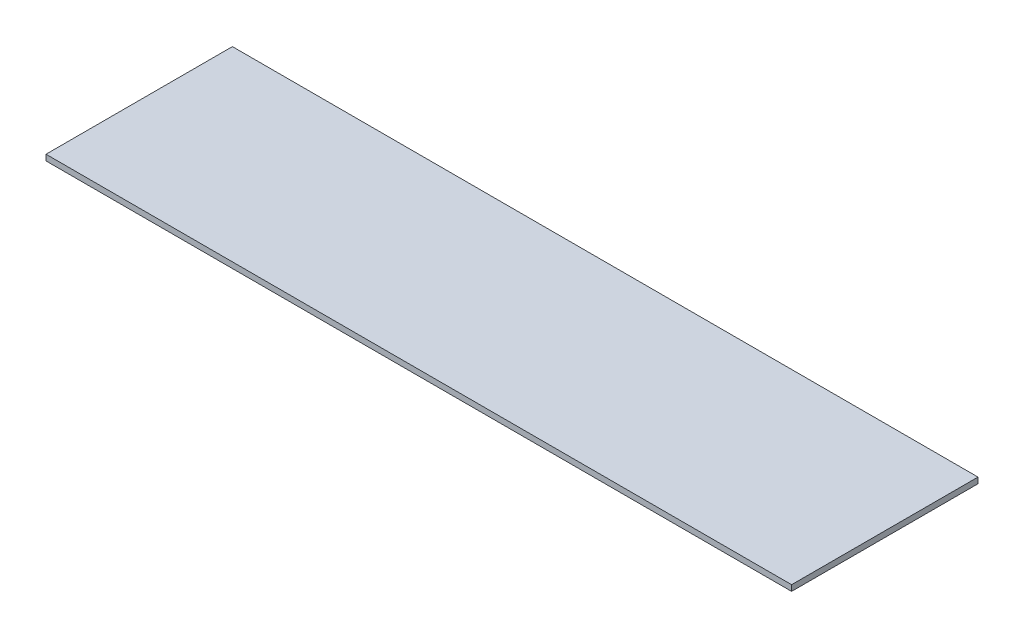
ISO-10303-21;
HEADER;
FILE_DESCRIPTION(('STEP AP214'),'2;1');
FILE_NAME('part.step','',(''),(''),'','','');
FILE_SCHEMA(('AUTOMOTIVE_DESIGN { 1 0 10303 214 1 1 1 1 }'));
ENDSEC;
DATA;
#1=APPLICATION_CONTEXT('core data for automotive mechanical design processes');
#2=APPLICATION_PROTOCOL_DEFINITION('international standard','automotive_design',2000,#1);
#3=PRODUCT_CONTEXT('',#1,'mechanical');
#4=PRODUCT('Part','Part','',(#3));
#5=PRODUCT_RELATED_PRODUCT_CATEGORY('part','',(#4));
#6=PRODUCT_DEFINITION_FORMATION('','',#4);
#7=PRODUCT_DEFINITION_CONTEXT('part definition',#1,'design');
#8=PRODUCT_DEFINITION('design','',#6,#7);
#9=PRODUCT_DEFINITION_SHAPE('','',#8);
#10=(LENGTH_UNIT() NAMED_UNIT(*) SI_UNIT(.MILLI.,.METRE.));
#11=(NAMED_UNIT(*) PLANE_ANGLE_UNIT() SI_UNIT($,.RADIAN.));
#12=(NAMED_UNIT(*) SI_UNIT($,.STERADIAN.) SOLID_ANGLE_UNIT());
#13=UNCERTAINTY_MEASURE_WITH_UNIT(LENGTH_MEASURE(1.E-05),#10,'distance_accuracy_value','');
#14=(GEOMETRIC_REPRESENTATION_CONTEXT(3) GLOBAL_UNCERTAINTY_ASSIGNED_CONTEXT((#13)) GLOBAL_UNIT_ASSIGNED_CONTEXT((#10,
#11,#12)) REPRESENTATION_CONTEXT('',''));
#15=CARTESIAN_POINT('',(0.,0.,0.));
#16=DIRECTION('',(0.,0.,1.));
#17=DIRECTION('',(1.,0.,0.));
#18=AXIS2_PLACEMENT_3D('',#15,#16,#17);
#19=CARTESIAN_POINT('',(0.,-83.437366020411,0.));
#20=DIRECTION('',(1.,0.,0.));
#21=DIRECTION('',(0.,0.,-1.));
#22=AXIS2_PLACEMENT_3D('',#19,#20,#21);
#23=PLANE('',#22);
#24=DIRECTION('',(0.,0.,-1.));
#25=VECTOR('',#24,1.);
#26=CARTESIAN_POINT('',(0.,-80.262366020411,0.));
#27=LINE('',#26,#25);
#28=CARTESIAN_POINT('',(0.,-80.262366020411,101.6));
#29=VERTEX_POINT('',#28);
#30=CARTESIAN_POINT('',(0.,-80.262366020411,0.));
#31=VERTEX_POINT('',#30);
#32=EDGE_CURVE('E98',#29,#31,#27,.T.);
#33=ORIENTED_EDGE('',*,*,#32,.T.);
#34=DIRECTION('',(0.,1.,0.));
#35=VECTOR('',#34,1.);
#36=CARTESIAN_POINT('',(0.,-83.437366020411,0.));
#37=LINE('',#36,#35);
#38=CARTESIAN_POINT('',(0.,-83.437366020411,0.));
#39=VERTEX_POINT('',#38);
#40=EDGE_CURVE('E11',#39,#31,#37,.T.);
#41=ORIENTED_EDGE('',*,*,#40,.F.);
#42=DIRECTION('',(0.,0.,-1.));
#43=VECTOR('',#42,1.);
#44=CARTESIAN_POINT('',(0.,-83.437366020411,0.));
#45=LINE('',#44,#43);
#46=CARTESIAN_POINT('',(0.,-83.437366020411,101.6));
#47=VERTEX_POINT('',#46);
#48=EDGE_CURVE('E86',#47,#39,#45,.T.);
#49=ORIENTED_EDGE('',*,*,#48,.F.);
#50=DIRECTION('',(0.,1.,0.));
#51=VECTOR('',#50,1.);
#52=CARTESIAN_POINT('',(0.,-83.437366020411,101.6));
#53=LINE('',#52,#51);
#54=EDGE_CURVE('E94',#47,#29,#53,.T.);
#55=ORIENTED_EDGE('',*,*,#54,.T.);
#56=EDGE_LOOP('',(#33,#41,#49,#55));
#57=FACE_BOUND('',#56,.T.);
#58=ADVANCED_FACE('F35',(#57),#23,.F.);
#59=CARTESIAN_POINT('',(0.,-83.437366020411,0.));
#60=DIRECTION('',(0.,0.,1.));
#61=DIRECTION('',(1.,0.,0.));
#62=AXIS2_PLACEMENT_3D('',#59,#60,#61);
#63=PLANE('',#62);
#64=DIRECTION('',(1.,0.,0.));
#65=VECTOR('',#64,1.);
#66=CARTESIAN_POINT('',(0.,-80.262366020411,0.));
#67=LINE('',#66,#65);
#68=CARTESIAN_POINT('',(406.4,-80.262366020411,0.));
#69=VERTEX_POINT('',#68);
#70=EDGE_CURVE('E90',#31,#69,#67,.T.);
#71=ORIENTED_EDGE('',*,*,#70,.T.);
#72=DIRECTION('',(0.,1.,0.));
#73=VECTOR('',#72,1.);
#74=CARTESIAN_POINT('',(406.4,-83.437366020411,0.));
#75=LINE('',#74,#73);
#76=CARTESIAN_POINT('',(406.4,-83.437366020411,0.));
#77=VERTEX_POINT('',#76);
#78=EDGE_CURVE('E43',#77,#69,#75,.T.);
#79=ORIENTED_EDGE('',*,*,#78,.F.);
#80=DIRECTION('',(1.,0.,0.));
#81=VECTOR('',#80,1.);
#82=CARTESIAN_POINT('',(0.,-83.437366020411,0.));
#83=LINE('',#82,#81);
#84=EDGE_CURVE('E81',#39,#77,#83,.T.);
#85=ORIENTED_EDGE('',*,*,#84,.F.);
#86=ORIENTED_EDGE('',*,*,#40,.T.);
#87=EDGE_LOOP('',(#71,#79,#85,#86));
#88=FACE_BOUND('',#87,.T.);
#89=ADVANCED_FACE('F89',(#88),#63,.F.);
#90=CARTESIAN_POINT('',(406.4,-83.437366020411,0.));
#91=DIRECTION('',(-1.,0.,0.));
#92=DIRECTION('',(0.,0.,1.));
#93=AXIS2_PLACEMENT_3D('',#90,#91,#92);
#94=PLANE('',#93);
#95=DIRECTION('',(0.,0.,1.));
#96=VECTOR('',#95,1.);
#97=CARTESIAN_POINT('',(406.4,-80.262366020411,0.));
#98=LINE('',#97,#96);
#99=CARTESIAN_POINT('',(406.4,-80.262366020411,101.6));
#100=VERTEX_POINT('',#99);
#101=EDGE_CURVE('E68',#69,#100,#98,.T.);
#102=ORIENTED_EDGE('',*,*,#101,.T.);
#103=DIRECTION('',(0.,1.,0.));
#104=VECTOR('',#103,1.);
#105=CARTESIAN_POINT('',(406.4,-83.437366020411,101.6));
#106=LINE('',#105,#104);
#107=CARTESIAN_POINT('',(406.4,-83.437366020411,101.6));
#108=VERTEX_POINT('',#107);
#109=EDGE_CURVE('E91',#108,#100,#106,.T.);
#110=ORIENTED_EDGE('',*,*,#109,.F.);
#111=DIRECTION('',(0.,0.,1.));
#112=VECTOR('',#111,1.);
#113=CARTESIAN_POINT('',(406.4,-83.437366020411,0.));
#114=LINE('',#113,#112);
#115=EDGE_CURVE('E84',#77,#108,#114,.T.);
#116=ORIENTED_EDGE('',*,*,#115,.F.);
#117=ORIENTED_EDGE('',*,*,#78,.T.);
#118=EDGE_LOOP('',(#102,#110,#116,#117));
#119=FACE_BOUND('',#118,.T.);
#120=ADVANCED_FACE('F92',(#119),#94,.F.);
#121=CARTESIAN_POINT('',(0.,-83.437366020411,101.6));
#122=DIRECTION('',(0.,0.,-1.));
#123=DIRECTION('',(-1.,0.,0.));
#124=AXIS2_PLACEMENT_3D('',#121,#122,#123);
#125=PLANE('',#124);
#126=DIRECTION('',(-1.,0.,0.));
#127=VECTOR('',#126,1.);
#128=CARTESIAN_POINT('',(0.,-80.262366020411,101.6));
#129=LINE('',#128,#127);
#130=EDGE_CURVE('E74',#100,#29,#129,.T.);
#131=ORIENTED_EDGE('',*,*,#130,.T.);
#132=ORIENTED_EDGE('',*,*,#54,.F.);
#133=DIRECTION('',(-1.,0.,0.));
#134=VECTOR('',#133,1.);
#135=CARTESIAN_POINT('',(0.,-83.437366020411,101.6));
#136=LINE('',#135,#134);
#137=EDGE_CURVE('E51',#108,#47,#136,.T.);
#138=ORIENTED_EDGE('',*,*,#137,.F.);
#139=ORIENTED_EDGE('',*,*,#109,.T.);
#140=EDGE_LOOP('',(#131,#132,#138,#139));
#141=FACE_BOUND('',#140,.T.);
#142=ADVANCED_FACE('F105',(#141),#125,.F.);
#143=CARTESIAN_POINT('',(0.,-83.437366020411,0.));
#144=DIRECTION('',(0.,1.,0.));
#145=DIRECTION('',(0.,0.,1.));
#146=AXIS2_PLACEMENT_3D('',#143,#144,#145);
#147=PLANE('',#146);
#148=ORIENTED_EDGE('',*,*,#48,.T.);
#149=ORIENTED_EDGE('',*,*,#84,.T.);
#150=ORIENTED_EDGE('',*,*,#115,.T.);
#151=ORIENTED_EDGE('',*,*,#137,.T.);
#152=EDGE_LOOP('',(#148,#149,#150,#151));
#153=FACE_BOUND('',#152,.T.);
#154=ADVANCED_FACE('F82',(#153),#147,.F.);
#155=CARTESIAN_POINT('',(0.,-80.262366020411,0.));
#156=DIRECTION('',(0.,1.,0.));
#157=DIRECTION('',(0.,0.,1.));
#158=AXIS2_PLACEMENT_3D('',#155,#156,#157);
#159=PLANE('',#158);
#160=ORIENTED_EDGE('',*,*,#32,.F.);
#161=ORIENTED_EDGE('',*,*,#130,.F.);
#162=ORIENTED_EDGE('',*,*,#101,.F.);
#163=ORIENTED_EDGE('',*,*,#70,.F.);
#164=EDGE_LOOP('',(#160,#161,#162,#163));
#165=FACE_BOUND('',#164,.T.);
#166=ADVANCED_FACE('F108',(#165),#159,.T.);
#167=CLOSED_SHELL('',(#58,#89,#120,#142,#154,#166));
#168=MANIFOLD_SOLID_BREP('B2',#167);
#169=ADVANCED_BREP_SHAPE_REPRESENTATION('',(#18,#168),#14);
#170=SHAPE_DEFINITION_REPRESENTATION(#9,#169);
ENDSEC;
END-ISO-10303-21;
